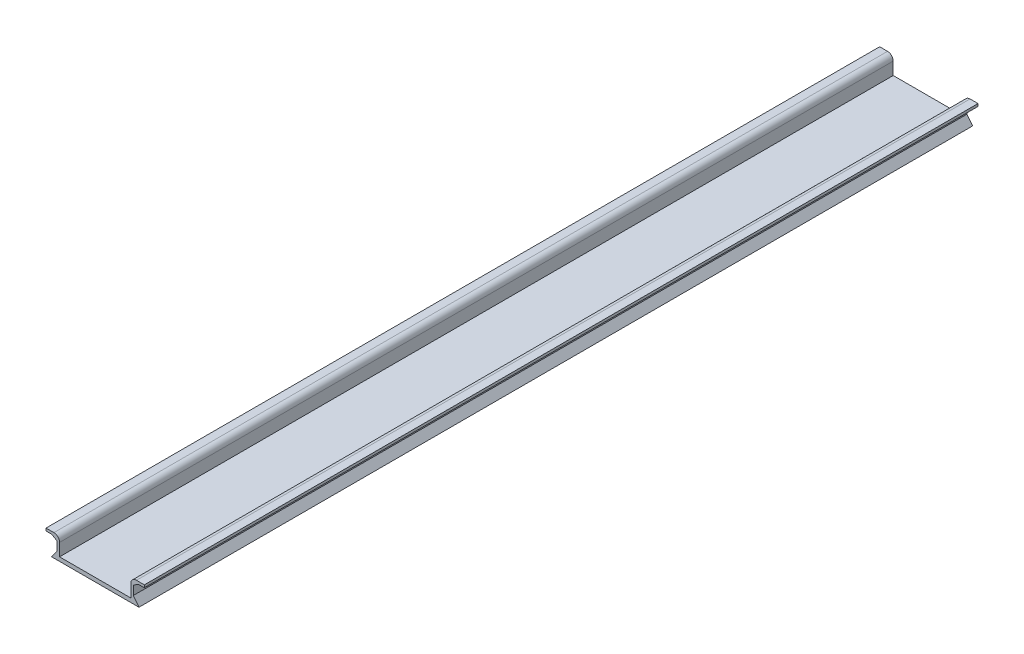
ISO-10303-21;
HEADER;
FILE_DESCRIPTION(('STEP AP214'),'2;1');
FILE_NAME('part.step','',(''),(''),'','','');
FILE_SCHEMA(('AUTOMOTIVE_DESIGN { 1 0 10303 214 1 1 1 1 }'));
ENDSEC;
DATA;
#1=APPLICATION_CONTEXT('core data for automotive mechanical design processes');
#2=APPLICATION_PROTOCOL_DEFINITION('international standard','automotive_design',2000,#1);
#3=PRODUCT_CONTEXT('',#1,'mechanical');
#4=PRODUCT('Part','Part','',(#3));
#5=PRODUCT_RELATED_PRODUCT_CATEGORY('part','',(#4));
#6=PRODUCT_DEFINITION_FORMATION('','',#4);
#7=PRODUCT_DEFINITION_CONTEXT('part definition',#1,'design');
#8=PRODUCT_DEFINITION('design','',#6,#7);
#9=PRODUCT_DEFINITION_SHAPE('','',#8);
#10=(LENGTH_UNIT() NAMED_UNIT(*) SI_UNIT(.MILLI.,.METRE.));
#11=(NAMED_UNIT(*) PLANE_ANGLE_UNIT() SI_UNIT($,.RADIAN.));
#12=(NAMED_UNIT(*) SI_UNIT($,.STERADIAN.) SOLID_ANGLE_UNIT());
#13=UNCERTAINTY_MEASURE_WITH_UNIT(LENGTH_MEASURE(1.E-05),#10,'distance_accuracy_value','');
#14=(GEOMETRIC_REPRESENTATION_CONTEXT(3) GLOBAL_UNCERTAINTY_ASSIGNED_CONTEXT((#13)) GLOBAL_UNIT_ASSIGNED_CONTEXT((#10,
#11,#12)) REPRESENTATION_CONTEXT('',''));
#15=CARTESIAN_POINT('',(0.,0.,0.));
#16=DIRECTION('',(0.,0.,1.));
#17=DIRECTION('',(1.,0.,0.));
#18=AXIS2_PLACEMENT_3D('',#15,#16,#17);
#19=CARTESIAN_POINT('',(15.5,0.,295.));
#20=DIRECTION('',(-0.7926239891046,-0.609710760849692,0.));
#21=DIRECTION('',(0.609710760849692,-0.7926239891046,0.));
#22=AXIS2_PLACEMENT_3D('',#19,#20,#21);
#23=PLANE('',#22);
#24=DIRECTION('',(-0.609710760849692,0.7926239891046,0.));
#25=VECTOR('',#24,1.);
#26=CARTESIAN_POINT('',(15.5,0.,0.));
#27=LINE('',#26,#25);
#28=CARTESIAN_POINT('',(15.5,0.,0.));
#29=VERTEX_POINT('',#28);
#30=CARTESIAN_POINT('',(13.5,2.6,0.));
#31=VERTEX_POINT('',#30);
#32=EDGE_CURVE('E204',#29,#31,#27,.T.);
#33=ORIENTED_EDGE('',*,*,#32,.T.);
#34=DIRECTION('',(0.,0.,-1.));
#35=VECTOR('',#34,1.);
#36=CARTESIAN_POINT('',(13.5,2.6,295.));
#37=LINE('',#36,#35);
#38=CARTESIAN_POINT('',(13.5,2.6,295.));
#39=VERTEX_POINT('',#38);
#40=EDGE_CURVE('E11',#39,#31,#37,.T.);
#41=ORIENTED_EDGE('',*,*,#40,.F.);
#42=DIRECTION('',(-0.609710760849692,0.7926239891046,0.));
#43=VECTOR('',#42,1.);
#44=CARTESIAN_POINT('',(15.5,0.,295.));
#45=LINE('',#44,#43);
#46=CARTESIAN_POINT('',(15.5,0.,295.));
#47=VERTEX_POINT('',#46);
#48=EDGE_CURVE('E256',#47,#39,#45,.T.);
#49=ORIENTED_EDGE('',*,*,#48,.F.);
#50=DIRECTION('',(0.,0.,-1.));
#51=VECTOR('',#50,1.);
#52=CARTESIAN_POINT('',(15.5,0.,295.));
#53=LINE('',#52,#51);
#54=EDGE_CURVE('E200',#47,#29,#53,.T.);
#55=ORIENTED_EDGE('',*,*,#54,.T.);
#56=EDGE_LOOP('',(#33,#41,#49,#55));
#57=FACE_BOUND('',#56,.T.);
#58=ADVANCED_FACE('F43',(#57),#23,.F.);
#59=CARTESIAN_POINT('',(13.5,2.6,295.));
#60=DIRECTION('',(-1.,0.,0.));
#61=DIRECTION('',(0.,0.,1.));
#62=AXIS2_PLACEMENT_3D('',#59,#60,#61);
#63=PLANE('',#62);
#64=DIRECTION('',(0.,1.,0.));
#65=VECTOR('',#64,1.);
#66=CARTESIAN_POINT('',(13.5,2.6,0.));
#67=LINE('',#66,#65);
#68=CARTESIAN_POINT('',(13.5,5.8,0.));
#69=VERTEX_POINT('',#68);
#70=EDGE_CURVE('E208',#31,#69,#67,.T.);
#71=ORIENTED_EDGE('',*,*,#70,.T.);
#72=DIRECTION('',(0.,0.,-1.));
#73=VECTOR('',#72,1.);
#74=CARTESIAN_POINT('',(13.5,5.8,295.));
#75=LINE('',#74,#73);
#76=CARTESIAN_POINT('',(13.5,5.8,295.));
#77=VERTEX_POINT('',#76);
#78=EDGE_CURVE('E52',#77,#69,#75,.T.);
#79=ORIENTED_EDGE('',*,*,#78,.F.);
#80=DIRECTION('',(0.,1.,0.));
#81=VECTOR('',#80,1.);
#82=CARTESIAN_POINT('',(13.5,2.6,295.));
#83=LINE('',#82,#81);
#84=EDGE_CURVE('E133',#39,#77,#83,.T.);
#85=ORIENTED_EDGE('',*,*,#84,.F.);
#86=ORIENTED_EDGE('',*,*,#40,.T.);
#87=EDGE_LOOP('',(#71,#79,#85,#86));
#88=FACE_BOUND('',#87,.T.);
#89=ADVANCED_FACE('F392',(#88),#63,.F.);
#90=CARTESIAN_POINT('',(13.5,5.8,295.));
#91=DIRECTION('',(-0.528301886792454,0.849056603773584,0.));
#92=DIRECTION('',(-0.849056603773584,-0.528301886792454,0.));
#93=AXIS2_PLACEMENT_3D('',#90,#91,#92);
#94=PLANE('',#93);
#95=DIRECTION('',(0.849056603773584,0.528301886792454,0.));
#96=VECTOR('',#95,1.);
#97=CARTESIAN_POINT('',(13.5,5.8,0.));
#98=LINE('',#97,#96);
#99=CARTESIAN_POINT('',(15.3,6.92,0.));
#100=VERTEX_POINT('',#99);
#101=EDGE_CURVE('E211',#69,#100,#98,.T.);
#102=ORIENTED_EDGE('',*,*,#101,.T.);
#103=DIRECTION('',(0.,0.,-1.));
#104=VECTOR('',#103,1.);
#105=CARTESIAN_POINT('',(15.3,6.92,295.));
#106=LINE('',#105,#104);
#107=CARTESIAN_POINT('',(15.3,6.92,295.));
#108=VERTEX_POINT('',#107);
#109=EDGE_CURVE('E307',#108,#100,#106,.T.);
#110=ORIENTED_EDGE('',*,*,#109,.F.);
#111=DIRECTION('',(0.849056603773584,0.528301886792454,0.));
#112=VECTOR('',#111,1.);
#113=CARTESIAN_POINT('',(13.5,5.8,295.));
#114=LINE('',#113,#112);
#115=EDGE_CURVE('E317',#77,#108,#114,.T.);
#116=ORIENTED_EDGE('',*,*,#115,.F.);
#117=ORIENTED_EDGE('',*,*,#78,.T.);
#118=EDGE_LOOP('',(#102,#110,#116,#117));
#119=FACE_BOUND('',#118,.T.);
#120=ADVANCED_FACE('F315',(#119),#94,.F.);
#121=CARTESIAN_POINT('',(15.3,6.92,295.));
#122=DIRECTION('',(0.,1.,0.));
#123=DIRECTION('',(0.,0.,1.));
#124=AXIS2_PLACEMENT_3D('',#121,#122,#123);
#125=PLANE('',#124);
#126=DIRECTION('',(1.,0.,0.));
#127=VECTOR('',#126,1.);
#128=CARTESIAN_POINT('',(15.3,6.92,0.));
#129=LINE('',#128,#127);
#130=CARTESIAN_POINT('',(17.4,6.92,0.));
#131=VERTEX_POINT('',#130);
#132=EDGE_CURVE('E214',#100,#131,#129,.T.);
#133=ORIENTED_EDGE('',*,*,#132,.T.);
#134=DIRECTION('',(0.,0.,-1.));
#135=VECTOR('',#134,1.);
#136=CARTESIAN_POINT('',(17.4,6.92,295.));
#137=LINE('',#136,#135);
#138=CARTESIAN_POINT('',(17.4,6.92,295.));
#139=VERTEX_POINT('',#138);
#140=EDGE_CURVE('E303',#139,#131,#137,.T.);
#141=ORIENTED_EDGE('',*,*,#140,.F.);
#142=DIRECTION('',(1.,0.,0.));
#143=VECTOR('',#142,1.);
#144=CARTESIAN_POINT('',(15.3,6.92,295.));
#145=LINE('',#144,#143);
#146=EDGE_CURVE('E336',#108,#139,#145,.T.);
#147=ORIENTED_EDGE('',*,*,#146,.F.);
#148=ORIENTED_EDGE('',*,*,#109,.T.);
#149=EDGE_LOOP('',(#133,#141,#147,#148));
#150=FACE_BOUND('',#149,.T.);
#151=ADVANCED_FACE('F326',(#150),#125,.F.);
#152=CARTESIAN_POINT('',(17.4,6.92,295.));
#153=DIRECTION('',(-1.,0.,0.));
#154=DIRECTION('',(0.,0.,1.));
#155=AXIS2_PLACEMENT_3D('',#152,#153,#154);
#156=PLANE('',#155);
#157=DIRECTION('',(0.,1.,0.));
#158=VECTOR('',#157,1.);
#159=CARTESIAN_POINT('',(17.4,6.92,0.));
#160=LINE('',#159,#158);
#161=CARTESIAN_POINT('',(17.4,7.82,0.));
#162=VERTEX_POINT('',#161);
#163=EDGE_CURVE('E217',#131,#162,#160,.T.);
#164=ORIENTED_EDGE('',*,*,#163,.T.);
#165=DIRECTION('',(0.,0.,-1.));
#166=VECTOR('',#165,1.);
#167=CARTESIAN_POINT('',(17.4,7.82,295.));
#168=LINE('',#167,#166);
#169=CARTESIAN_POINT('',(17.4,7.82,295.));
#170=VERTEX_POINT('',#169);
#171=EDGE_CURVE('E299',#170,#162,#168,.T.);
#172=ORIENTED_EDGE('',*,*,#171,.F.);
#173=DIRECTION('',(0.,1.,0.));
#174=VECTOR('',#173,1.);
#175=CARTESIAN_POINT('',(17.4,6.92,295.));
#176=LINE('',#175,#174);
#177=EDGE_CURVE('E332',#139,#170,#176,.T.);
#178=ORIENTED_EDGE('',*,*,#177,.F.);
#179=ORIENTED_EDGE('',*,*,#140,.T.);
#180=EDGE_LOOP('',(#164,#172,#178,#179));
#181=FACE_BOUND('',#180,.T.);
#182=ADVANCED_FACE('F330',(#181),#156,.F.);
#183=CARTESIAN_POINT('',(17.4,7.82,295.));
#184=DIRECTION('',(0.,-1.,0.));
#185=DIRECTION('',(0.,0.,-1.));
#186=AXIS2_PLACEMENT_3D('',#183,#184,#185);
#187=PLANE('',#186);
#188=DIRECTION('',(-1.,0.,0.));
#189=VECTOR('',#188,1.);
#190=CARTESIAN_POINT('',(17.4,7.82,0.));
#191=LINE('',#190,#189);
#192=CARTESIAN_POINT('',(14.6,7.82,0.));
#193=VERTEX_POINT('',#192);
#194=EDGE_CURVE('E220',#162,#193,#191,.T.);
#195=ORIENTED_EDGE('',*,*,#194,.T.);
#196=DIRECTION('',(0.,0.,-1.));
#197=VECTOR('',#196,1.);
#198=CARTESIAN_POINT('',(14.6,7.82,295.));
#199=LINE('',#198,#197);
#200=CARTESIAN_POINT('',(14.6,7.82,295.));
#201=VERTEX_POINT('',#200);
#202=EDGE_CURVE('E295',#201,#193,#199,.T.);
#203=ORIENTED_EDGE('',*,*,#202,.F.);
#204=DIRECTION('',(-1.,0.,0.));
#205=VECTOR('',#204,1.);
#206=CARTESIAN_POINT('',(17.4,7.82,295.));
#207=LINE('',#206,#205);
#208=EDGE_CURVE('E335',#170,#201,#207,.T.);
#209=ORIENTED_EDGE('',*,*,#208,.F.);
#210=ORIENTED_EDGE('',*,*,#171,.T.);
#211=EDGE_LOOP('',(#195,#203,#209,#210));
#212=FACE_BOUND('',#211,.T.);
#213=ADVANCED_FACE('F405',(#212),#187,.F.);
#214=CARTESIAN_POINT('',(14.6,5.82,295.));
#215=DIRECTION('',(0.,0.,-1.));
#216=DIRECTION('',(-1.,0.,0.));
#217=AXIS2_PLACEMENT_3D('',#214,#215,#216);
#218=CYLINDRICAL_SURFACE('',#217,2.);
#219=CARTESIAN_POINT('',(14.6,5.82,0.));
#220=DIRECTION('',(0.,0.,1.));
#221=DIRECTION('',(1.,0.,0.));
#222=AXIS2_PLACEMENT_3D('',#219,#220,#221);
#223=CIRCLE('',#222,2.);
#224=CARTESIAN_POINT('',(12.6,5.81999999999999,0.));
#225=VERTEX_POINT('',#224);
#226=EDGE_CURVE('E223',#193,#225,#223,.T.);
#227=ORIENTED_EDGE('',*,*,#226,.T.);
#228=DIRECTION('',(0.,0.,-1.));
#229=VECTOR('',#228,1.);
#230=CARTESIAN_POINT('',(12.6,5.81999999999999,295.));
#231=LINE('',#230,#229);
#232=CARTESIAN_POINT('',(12.6,5.81999999999999,295.));
#233=VERTEX_POINT('',#232);
#234=EDGE_CURVE('E291',#233,#225,#231,.T.);
#235=ORIENTED_EDGE('',*,*,#234,.F.);
#236=CARTESIAN_POINT('',(14.6,5.82,295.));
#237=DIRECTION('',(0.,0.,1.));
#238=DIRECTION('',(1.,0.,0.));
#239=AXIS2_PLACEMENT_3D('',#236,#237,#238);
#240=CIRCLE('',#239,2.);
#241=EDGE_CURVE('E340',#201,#233,#240,.T.);
#242=ORIENTED_EDGE('',*,*,#241,.F.);
#243=ORIENTED_EDGE('',*,*,#202,.T.);
#244=EDGE_LOOP('',(#227,#235,#242,#243));
#245=FACE_BOUND('',#244,.T.);
#246=ADVANCED_FACE('F408',(#245),#218,.T.);
#247=CARTESIAN_POINT('',(12.6,5.81999999999999,295.));
#248=DIRECTION('',(1.,0.,0.));
#249=DIRECTION('',(0.,1.,0.));
#250=AXIS2_PLACEMENT_3D('',#247,#248,#249);
#251=PLANE('',#250);
#252=DIRECTION('',(0.,-1.,0.));
#253=VECTOR('',#252,1.);
#254=CARTESIAN_POINT('',(12.6,5.81999999999999,0.));
#255=LINE('',#254,#253);
#256=CARTESIAN_POINT('',(12.6,1.4,0.));
#257=VERTEX_POINT('',#256);
#258=EDGE_CURVE('E226',#225,#257,#255,.T.);
#259=ORIENTED_EDGE('',*,*,#258,.T.);
#260=DIRECTION('',(0.,0.,-1.));
#261=VECTOR('',#260,1.);
#262=CARTESIAN_POINT('',(12.6,1.4,295.));
#263=LINE('',#262,#261);
#264=CARTESIAN_POINT('',(12.6,1.4,295.));
#265=VERTEX_POINT('',#264);
#266=EDGE_CURVE('E287',#265,#257,#263,.T.);
#267=ORIENTED_EDGE('',*,*,#266,.F.);
#268=DIRECTION('',(0.,-1.,0.));
#269=VECTOR('',#268,1.);
#270=CARTESIAN_POINT('',(12.6,5.81999999999999,295.));
#271=LINE('',#270,#269);
#272=EDGE_CURVE('E347',#233,#265,#271,.T.);
#273=ORIENTED_EDGE('',*,*,#272,.F.);
#274=ORIENTED_EDGE('',*,*,#234,.T.);
#275=EDGE_LOOP('',(#259,#267,#273,#274));
#276=FACE_BOUND('',#275,.T.);
#277=ADVANCED_FACE('F412',(#276),#251,.F.);
#278=CARTESIAN_POINT('',(12.6,1.4,295.));
#279=DIRECTION('',(0.,-1.,0.));
#280=DIRECTION('',(1.,0.,0.));
#281=AXIS2_PLACEMENT_3D('',#278,#279,#280);
#282=PLANE('',#281);
#283=DIRECTION('',(-1.,0.,0.));
#284=VECTOR('',#283,1.);
#285=CARTESIAN_POINT('',(12.6,1.4,0.));
#286=LINE('',#285,#284);
#287=CARTESIAN_POINT('',(-12.6,1.4,0.));
#288=VERTEX_POINT('',#287);
#289=EDGE_CURVE('E229',#257,#288,#286,.T.);
#290=ORIENTED_EDGE('',*,*,#289,.T.);
#291=DIRECTION('',(0.,0.,-1.));
#292=VECTOR('',#291,1.);
#293=CARTESIAN_POINT('',(-12.6,1.4,295.));
#294=LINE('',#293,#292);
#295=CARTESIAN_POINT('',(-12.6,1.4,295.));
#296=VERTEX_POINT('',#295);
#297=EDGE_CURVE('E283',#296,#288,#294,.T.);
#298=ORIENTED_EDGE('',*,*,#297,.F.);
#299=DIRECTION('',(-1.,0.,0.));
#300=VECTOR('',#299,1.);
#301=CARTESIAN_POINT('',(12.6,1.4,295.));
#302=LINE('',#301,#300);
#303=EDGE_CURVE('E350',#265,#296,#302,.T.);
#304=ORIENTED_EDGE('',*,*,#303,.F.);
#305=ORIENTED_EDGE('',*,*,#266,.T.);
#306=EDGE_LOOP('',(#290,#298,#304,#305));
#307=FACE_BOUND('',#306,.T.);
#308=ADVANCED_FACE('F416',(#307),#282,.F.);
#309=CARTESIAN_POINT('',(-12.6,5.81999999999998,295.));
#310=DIRECTION('',(-1.,0.,0.));
#311=DIRECTION('',(0.,-1.,0.));
#312=AXIS2_PLACEMENT_3D('',#309,#310,#311);
#313=PLANE('',#312);
#314=DIRECTION('',(0.,1.,0.));
#315=VECTOR('',#314,1.);
#316=CARTESIAN_POINT('',(-12.6,5.81999999999998,0.));
#317=LINE('',#316,#315);
#318=CARTESIAN_POINT('',(-12.6,5.81999999999998,0.));
#319=VERTEX_POINT('',#318);
#320=EDGE_CURVE('E232',#288,#319,#317,.T.);
#321=ORIENTED_EDGE('',*,*,#320,.T.);
#322=DIRECTION('',(0.,0.,-1.));
#323=VECTOR('',#322,1.);
#324=CARTESIAN_POINT('',(-12.6,5.81999999999998,295.));
#325=LINE('',#324,#323);
#326=CARTESIAN_POINT('',(-12.6,5.81999999999998,295.));
#327=VERTEX_POINT('',#326);
#328=EDGE_CURVE('E279',#327,#319,#325,.T.);
#329=ORIENTED_EDGE('',*,*,#328,.F.);
#330=DIRECTION('',(0.,1.,0.));
#331=VECTOR('',#330,1.);
#332=CARTESIAN_POINT('',(-12.6,5.81999999999998,295.));
#333=LINE('',#332,#331);
#334=EDGE_CURVE('E353',#296,#327,#333,.T.);
#335=ORIENTED_EDGE('',*,*,#334,.F.);
#336=ORIENTED_EDGE('',*,*,#297,.T.);
#337=EDGE_LOOP('',(#321,#329,#335,#336));
#338=FACE_BOUND('',#337,.T.);
#339=ADVANCED_FACE('F420',(#338),#313,.F.);
#340=CARTESIAN_POINT('',(-14.6,5.81999999999999,295.));
#341=DIRECTION('',(0.,0.,-1.));
#342=DIRECTION('',(-1.,0.,0.));
#343=AXIS2_PLACEMENT_3D('',#340,#341,#342);
#344=CYLINDRICAL_SURFACE('',#343,2.);
#345=CARTESIAN_POINT('',(-14.6,5.81999999999999,0.));
#346=DIRECTION('',(0.,0.,1.));
#347=DIRECTION('',(-1.,0.,0.));
#348=AXIS2_PLACEMENT_3D('',#345,#346,#347);
#349=CIRCLE('',#348,2.);
#350=CARTESIAN_POINT('',(-14.6,7.81999999999999,0.));
#351=VERTEX_POINT('',#350);
#352=EDGE_CURVE('E235',#319,#351,#349,.T.);
#353=ORIENTED_EDGE('',*,*,#352,.T.);
#354=DIRECTION('',(0.,0.,-1.));
#355=VECTOR('',#354,1.);
#356=CARTESIAN_POINT('',(-14.6,7.81999999999999,295.));
#357=LINE('',#356,#355);
#358=CARTESIAN_POINT('',(-14.6,7.81999999999999,295.));
#359=VERTEX_POINT('',#358);
#360=EDGE_CURVE('E275',#359,#351,#357,.T.);
#361=ORIENTED_EDGE('',*,*,#360,.F.);
#362=CARTESIAN_POINT('',(-14.6,5.81999999999999,295.));
#363=DIRECTION('',(0.,0.,1.));
#364=DIRECTION('',(-1.,0.,0.));
#365=AXIS2_PLACEMENT_3D('',#362,#363,#364);
#366=CIRCLE('',#365,2.);
#367=EDGE_CURVE('E356',#327,#359,#366,.T.);
#368=ORIENTED_EDGE('',*,*,#367,.F.);
#369=ORIENTED_EDGE('',*,*,#328,.T.);
#370=EDGE_LOOP('',(#353,#361,#368,#369));
#371=FACE_BOUND('',#370,.T.);
#372=ADVANCED_FACE('F424',(#371),#344,.T.);
#373=CARTESIAN_POINT('',(-17.4,7.81999999999999,295.));
#374=DIRECTION('',(0.,-1.,0.));
#375=DIRECTION('',(0.,0.,-1.));
#376=AXIS2_PLACEMENT_3D('',#373,#374,#375);
#377=PLANE('',#376);
#378=DIRECTION('',(-1.,0.,0.));
#379=VECTOR('',#378,1.);
#380=CARTESIAN_POINT('',(-17.4,7.81999999999999,0.));
#381=LINE('',#380,#379);
#382=CARTESIAN_POINT('',(-17.4,7.81999999999999,0.));
#383=VERTEX_POINT('',#382);
#384=EDGE_CURVE('E238',#351,#383,#381,.T.);
#385=ORIENTED_EDGE('',*,*,#384,.T.);
#386=DIRECTION('',(0.,0.,-1.));
#387=VECTOR('',#386,1.);
#388=CARTESIAN_POINT('',(-17.4,7.81999999999999,295.));
#389=LINE('',#388,#387);
#390=CARTESIAN_POINT('',(-17.4,7.81999999999999,295.));
#391=VERTEX_POINT('',#390);
#392=EDGE_CURVE('E271',#391,#383,#389,.T.);
#393=ORIENTED_EDGE('',*,*,#392,.F.);
#394=DIRECTION('',(-1.,0.,0.));
#395=VECTOR('',#394,1.);
#396=CARTESIAN_POINT('',(-17.4,7.81999999999999,295.));
#397=LINE('',#396,#395);
#398=EDGE_CURVE('E359',#359,#391,#397,.T.);
#399=ORIENTED_EDGE('',*,*,#398,.F.);
#400=ORIENTED_EDGE('',*,*,#360,.T.);
#401=EDGE_LOOP('',(#385,#393,#399,#400));
#402=FACE_BOUND('',#401,.T.);
#403=ADVANCED_FACE('F428',(#402),#377,.F.);
#404=CARTESIAN_POINT('',(-17.4,6.91999999999999,295.));
#405=DIRECTION('',(1.,0.,0.));
#406=DIRECTION('',(0.,0.,-1.));
#407=AXIS2_PLACEMENT_3D('',#404,#405,#406);
#408=PLANE('',#407);
#409=DIRECTION('',(0.,-1.,0.));
#410=VECTOR('',#409,1.);
#411=CARTESIAN_POINT('',(-17.4,6.91999999999999,0.));
#412=LINE('',#411,#410);
#413=CARTESIAN_POINT('',(-17.4,6.91999999999999,0.));
#414=VERTEX_POINT('',#413);
#415=EDGE_CURVE('E241',#383,#414,#412,.T.);
#416=ORIENTED_EDGE('',*,*,#415,.T.);
#417=DIRECTION('',(0.,0.,-1.));
#418=VECTOR('',#417,1.);
#419=CARTESIAN_POINT('',(-17.4,6.91999999999999,295.));
#420=LINE('',#419,#418);
#421=CARTESIAN_POINT('',(-17.4,6.91999999999999,295.));
#422=VERTEX_POINT('',#421);
#423=EDGE_CURVE('E267',#422,#414,#420,.T.);
#424=ORIENTED_EDGE('',*,*,#423,.F.);
#425=DIRECTION('',(0.,-1.,0.));
#426=VECTOR('',#425,1.);
#427=CARTESIAN_POINT('',(-17.4,6.91999999999999,295.));
#428=LINE('',#427,#426);
#429=EDGE_CURVE('E362',#391,#422,#428,.T.);
#430=ORIENTED_EDGE('',*,*,#429,.F.);
#431=ORIENTED_EDGE('',*,*,#392,.T.);
#432=EDGE_LOOP('',(#416,#424,#430,#431));
#433=FACE_BOUND('',#432,.T.);
#434=ADVANCED_FACE('F432',(#433),#408,.F.);
#435=CARTESIAN_POINT('',(-15.3,6.91999999999999,295.));
#436=DIRECTION('',(0.,1.,0.));
#437=DIRECTION('',(0.,0.,1.));
#438=AXIS2_PLACEMENT_3D('',#435,#436,#437);
#439=PLANE('',#438);
#440=DIRECTION('',(1.,0.,0.));
#441=VECTOR('',#440,1.);
#442=CARTESIAN_POINT('',(-15.3,6.91999999999999,0.));
#443=LINE('',#442,#441);
#444=CARTESIAN_POINT('',(-15.3,6.91999999999999,0.));
#445=VERTEX_POINT('',#444);
#446=EDGE_CURVE('E244',#414,#445,#443,.T.);
#447=ORIENTED_EDGE('',*,*,#446,.T.);
#448=DIRECTION('',(0.,0.,-1.));
#449=VECTOR('',#448,1.);
#450=CARTESIAN_POINT('',(-15.3,6.91999999999999,295.));
#451=LINE('',#450,#449);
#452=CARTESIAN_POINT('',(-15.3,6.91999999999999,295.));
#453=VERTEX_POINT('',#452);
#454=EDGE_CURVE('E263',#453,#445,#451,.T.);
#455=ORIENTED_EDGE('',*,*,#454,.F.);
#456=DIRECTION('',(1.,0.,0.));
#457=VECTOR('',#456,1.);
#458=CARTESIAN_POINT('',(-15.3,6.91999999999999,295.));
#459=LINE('',#458,#457);
#460=EDGE_CURVE('E365',#422,#453,#459,.T.);
#461=ORIENTED_EDGE('',*,*,#460,.F.);
#462=ORIENTED_EDGE('',*,*,#423,.T.);
#463=EDGE_LOOP('',(#447,#455,#461,#462));
#464=FACE_BOUND('',#463,.T.);
#465=ADVANCED_FACE('F373',(#464),#439,.F.);
#466=CARTESIAN_POINT('',(-13.5,5.79999999999999,295.));
#467=DIRECTION('',(0.528301886792453,0.849056603773585,0.));
#468=DIRECTION('',(-0.849056603773585,0.528301886792453,0.));
#469=AXIS2_PLACEMENT_3D('',#466,#467,#468);
#470=PLANE('',#469);
#471=DIRECTION('',(0.849056603773585,-0.528301886792453,0.));
#472=VECTOR('',#471,1.);
#473=CARTESIAN_POINT('',(-13.5,5.79999999999999,0.));
#474=LINE('',#473,#472);
#475=CARTESIAN_POINT('',(-13.5,5.79999999999999,0.));
#476=VERTEX_POINT('',#475);
#477=EDGE_CURVE('E247',#445,#476,#474,.T.);
#478=ORIENTED_EDGE('',*,*,#477,.T.);
#479=DIRECTION('',(0.,0.,-1.));
#480=VECTOR('',#479,1.);
#481=CARTESIAN_POINT('',(-13.5,5.79999999999999,295.));
#482=LINE('',#481,#480);
#483=CARTESIAN_POINT('',(-13.5,5.79999999999999,295.));
#484=VERTEX_POINT('',#483);
#485=EDGE_CURVE('E193',#484,#476,#482,.T.);
#486=ORIENTED_EDGE('',*,*,#485,.F.);
#487=DIRECTION('',(0.849056603773585,-0.528301886792453,0.));
#488=VECTOR('',#487,1.);
#489=CARTESIAN_POINT('',(-13.5,5.79999999999999,295.));
#490=LINE('',#489,#488);
#491=EDGE_CURVE('E182',#453,#484,#490,.T.);
#492=ORIENTED_EDGE('',*,*,#491,.F.);
#493=ORIENTED_EDGE('',*,*,#454,.T.);
#494=EDGE_LOOP('',(#478,#486,#492,#493));
#495=FACE_BOUND('',#494,.T.);
#496=ADVANCED_FACE('F377',(#495),#470,.F.);
#497=CARTESIAN_POINT('',(-13.5,2.59999999999999,295.));
#498=DIRECTION('',(1.,0.,0.));
#499=DIRECTION('',(0.,0.,-1.));
#500=AXIS2_PLACEMENT_3D('',#497,#498,#499);
#501=PLANE('',#500);
#502=DIRECTION('',(0.,-1.,0.));
#503=VECTOR('',#502,1.);
#504=CARTESIAN_POINT('',(-13.5,2.59999999999999,0.));
#505=LINE('',#504,#503);
#506=CARTESIAN_POINT('',(-13.5,2.59999999999999,0.));
#507=VERTEX_POINT('',#506);
#508=EDGE_CURVE('E191',#476,#507,#505,.T.);
#509=ORIENTED_EDGE('',*,*,#508,.T.);
#510=DIRECTION('',(0.,0.,-1.));
#511=VECTOR('',#510,1.);
#512=CARTESIAN_POINT('',(-13.5,2.59999999999999,295.));
#513=LINE('',#512,#511);
#514=CARTESIAN_POINT('',(-13.5,2.59999999999999,295.));
#515=VERTEX_POINT('',#514);
#516=EDGE_CURVE('E188',#515,#507,#513,.T.);
#517=ORIENTED_EDGE('',*,*,#516,.F.);
#518=DIRECTION('',(0.,-1.,0.));
#519=VECTOR('',#518,1.);
#520=CARTESIAN_POINT('',(-13.5,2.59999999999999,295.));
#521=LINE('',#520,#519);
#522=EDGE_CURVE('E176',#484,#515,#521,.T.);
#523=ORIENTED_EDGE('',*,*,#522,.F.);
#524=ORIENTED_EDGE('',*,*,#485,.T.);
#525=EDGE_LOOP('',(#509,#517,#523,#524));
#526=FACE_BOUND('',#525,.T.);
#527=ADVANCED_FACE('F189',(#526),#501,.F.);
#528=CARTESIAN_POINT('',(-15.5,0.,295.));
#529=DIRECTION('',(0.7926239891046,-0.609710760849693,0.));
#530=DIRECTION('',(0.609710760849693,0.7926239891046,0.));
#531=AXIS2_PLACEMENT_3D('',#528,#529,#530);
#532=PLANE('',#531);
#533=DIRECTION('',(-0.609710760849693,-0.7926239891046,0.));
#534=VECTOR('',#533,1.);
#535=CARTESIAN_POINT('',(-15.5,0.,0.));
#536=LINE('',#535,#534);
#537=CARTESIAN_POINT('',(-15.5,0.,0.));
#538=VERTEX_POINT('',#537);
#539=EDGE_CURVE('E119',#507,#538,#536,.T.);
#540=ORIENTED_EDGE('',*,*,#539,.T.);
#541=DIRECTION('',(0.,0.,-1.));
#542=VECTOR('',#541,1.);
#543=CARTESIAN_POINT('',(-15.5,0.,295.));
#544=LINE('',#543,#542);
#545=CARTESIAN_POINT('',(-15.5,0.,295.));
#546=VERTEX_POINT('',#545);
#547=EDGE_CURVE('E194',#546,#538,#544,.T.);
#548=ORIENTED_EDGE('',*,*,#547,.F.);
#549=DIRECTION('',(-0.609710760849693,-0.7926239891046,0.));
#550=VECTOR('',#549,1.);
#551=CARTESIAN_POINT('',(-15.5,0.,295.));
#552=LINE('',#551,#550);
#553=EDGE_CURVE('E180',#515,#546,#552,.T.);
#554=ORIENTED_EDGE('',*,*,#553,.F.);
#555=ORIENTED_EDGE('',*,*,#516,.T.);
#556=EDGE_LOOP('',(#540,#548,#554,#555));
#557=FACE_BOUND('',#556,.T.);
#558=ADVANCED_FACE('F196',(#557),#532,.F.);
#559=CARTESIAN_POINT('',(-15.5,0.,295.));
#560=DIRECTION('',(0.,1.,0.));
#561=DIRECTION('',(0.,0.,1.));
#562=AXIS2_PLACEMENT_3D('',#559,#560,#561);
#563=PLANE('',#562);
#564=DIRECTION('',(1.,0.,0.));
#565=VECTOR('',#564,1.);
#566=CARTESIAN_POINT('',(-15.5,0.,0.));
#567=LINE('',#566,#565);
#568=EDGE_CURVE('E125',#538,#29,#567,.T.);
#569=ORIENTED_EDGE('',*,*,#568,.T.);
#570=ORIENTED_EDGE('',*,*,#54,.F.);
#571=DIRECTION('',(1.,0.,0.));
#572=VECTOR('',#571,1.);
#573=CARTESIAN_POINT('',(-15.5,0.,295.));
#574=LINE('',#573,#572);
#575=EDGE_CURVE('E60',#546,#47,#574,.T.);
#576=ORIENTED_EDGE('',*,*,#575,.F.);
#577=ORIENTED_EDGE('',*,*,#547,.T.);
#578=EDGE_LOOP('',(#569,#570,#576,#577));
#579=FACE_BOUND('',#578,.T.);
#580=ADVANCED_FACE('F381',(#579),#563,.F.);
#581=CARTESIAN_POINT('',(14.6,5.82,295.));
#582=DIRECTION('',(0.,0.,1.));
#583=DIRECTION('',(1.,0.,0.));
#584=AXIS2_PLACEMENT_3D('',#581,#582,#583);
#585=PLANE('',#584);
#586=ORIENTED_EDGE('',*,*,#48,.T.);
#587=ORIENTED_EDGE('',*,*,#84,.T.);
#588=ORIENTED_EDGE('',*,*,#115,.T.);
#589=ORIENTED_EDGE('',*,*,#146,.T.);
#590=ORIENTED_EDGE('',*,*,#177,.T.);
#591=ORIENTED_EDGE('',*,*,#208,.T.);
#592=ORIENTED_EDGE('',*,*,#241,.T.);
#593=ORIENTED_EDGE('',*,*,#272,.T.);
#594=ORIENTED_EDGE('',*,*,#303,.T.);
#595=ORIENTED_EDGE('',*,*,#334,.T.);
#596=ORIENTED_EDGE('',*,*,#367,.T.);
#597=ORIENTED_EDGE('',*,*,#398,.T.);
#598=ORIENTED_EDGE('',*,*,#429,.T.);
#599=ORIENTED_EDGE('',*,*,#460,.T.);
#600=ORIENTED_EDGE('',*,*,#491,.T.);
#601=ORIENTED_EDGE('',*,*,#522,.T.);
#602=ORIENTED_EDGE('',*,*,#553,.T.);
#603=ORIENTED_EDGE('',*,*,#575,.T.);
#604=EDGE_LOOP('',(#586,#587,#588,#589,#590,#591,#592,#593,#594,#595,#596,#597,#598,#599,#600,
#601,#602,#603));
#605=FACE_BOUND('',#604,.T.);
#606=ADVANCED_FACE('F178',(#605),#585,.T.);
#607=CARTESIAN_POINT('',(14.6,5.82,0.));
#608=DIRECTION('',(0.,0.,1.));
#609=DIRECTION('',(1.,0.,0.));
#610=AXIS2_PLACEMENT_3D('',#607,#608,#609);
#611=PLANE('',#610);
#612=ORIENTED_EDGE('',*,*,#32,.F.);
#613=ORIENTED_EDGE('',*,*,#568,.F.);
#614=ORIENTED_EDGE('',*,*,#539,.F.);
#615=ORIENTED_EDGE('',*,*,#508,.F.);
#616=ORIENTED_EDGE('',*,*,#477,.F.);
#617=ORIENTED_EDGE('',*,*,#446,.F.);
#618=ORIENTED_EDGE('',*,*,#415,.F.);
#619=ORIENTED_EDGE('',*,*,#384,.F.);
#620=ORIENTED_EDGE('',*,*,#352,.F.);
#621=ORIENTED_EDGE('',*,*,#320,.F.);
#622=ORIENTED_EDGE('',*,*,#289,.F.);
#623=ORIENTED_EDGE('',*,*,#258,.F.);
#624=ORIENTED_EDGE('',*,*,#226,.F.);
#625=ORIENTED_EDGE('',*,*,#194,.F.);
#626=ORIENTED_EDGE('',*,*,#163,.F.);
#627=ORIENTED_EDGE('',*,*,#132,.F.);
#628=ORIENTED_EDGE('',*,*,#101,.F.);
#629=ORIENTED_EDGE('',*,*,#70,.F.);
#630=EDGE_LOOP('',(#612,#613,#614,#615,#616,#617,#618,#619,#620,#621,#622,#623,#624,#625,#626,
#627,#628,#629));
#631=FACE_BOUND('',#630,.T.);
#632=ADVANCED_FACE('F321',(#631),#611,.F.);
#633=CLOSED_SHELL('',(#58,#89,#120,#151,#182,#213,#246,#277,#308,#339,#372,#403,#434,#465,#496,
#527,#558,#580,#606,#632));
#634=MANIFOLD_SOLID_BREP('B2',#633);
#635=ADVANCED_BREP_SHAPE_REPRESENTATION('',(#18,#634),#14);
#636=SHAPE_DEFINITION_REPRESENTATION(#9,#635);
ENDSEC;
END-ISO-10303-21;
